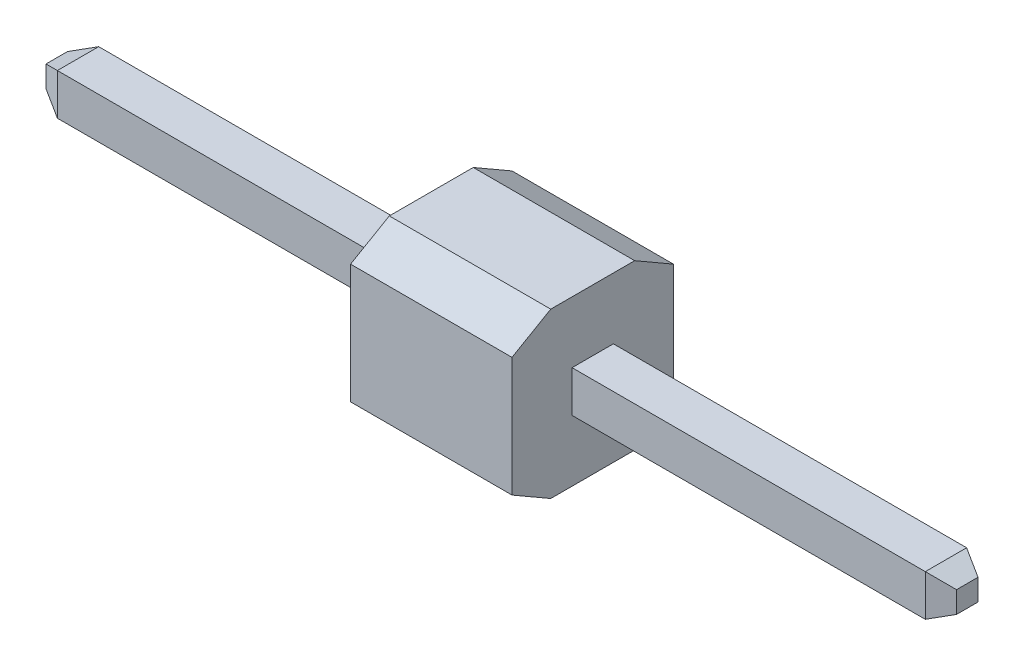
ISO-10303-21;
HEADER;
FILE_DESCRIPTION(('STEP AP214'),'2;1');
FILE_NAME('part.step','',(''),(''),'','','');
FILE_SCHEMA(('AUTOMOTIVE_DESIGN { 1 0 10303 214 1 1 1 1 }'));
ENDSEC;
DATA;
#1=APPLICATION_CONTEXT('core data for automotive mechanical design processes');
#2=APPLICATION_PROTOCOL_DEFINITION('international standard','automotive_design',2000,#1);
#3=PRODUCT_CONTEXT('',#1,'mechanical');
#4=PRODUCT('Part','Part','',(#3));
#5=PRODUCT_RELATED_PRODUCT_CATEGORY('part','',(#4));
#6=PRODUCT_DEFINITION_FORMATION('','',#4);
#7=PRODUCT_DEFINITION_CONTEXT('part definition',#1,'design');
#8=PRODUCT_DEFINITION('design','',#6,#7);
#9=PRODUCT_DEFINITION_SHAPE('','',#8);
#10=(LENGTH_UNIT() NAMED_UNIT(*) SI_UNIT(.MILLI.,.METRE.));
#11=(NAMED_UNIT(*) PLANE_ANGLE_UNIT() SI_UNIT($,.RADIAN.));
#12=(NAMED_UNIT(*) SI_UNIT($,.STERADIAN.) SOLID_ANGLE_UNIT());
#13=UNCERTAINTY_MEASURE_WITH_UNIT(LENGTH_MEASURE(1.E-05),#10,'distance_accuracy_value','');
#14=(GEOMETRIC_REPRESENTATION_CONTEXT(3) GLOBAL_UNCERTAINTY_ASSIGNED_CONTEXT((#13)) GLOBAL_UNIT_ASSIGNED_CONTEXT((#10,
#11,#12)) REPRESENTATION_CONTEXT('',''));
#15=CARTESIAN_POINT('',(0.,0.,0.));
#16=DIRECTION('',(0.,0.,1.));
#17=DIRECTION('',(1.,0.,0.));
#18=AXIS2_PLACEMENT_3D('',#15,#16,#17);
#19=CARTESIAN_POINT('',(5.42109994297276,-4.76288427394286,-2.77112015145706));
#20=DIRECTION('',(1.,-9.93476518829084E-08,4.37113882867379E-08));
#21=DIRECTION('',(-9.93476589883358E-08,-1.,8.74227765734759E-08));
#22=AXIS2_PLACEMENT_3D('',#19,#20,#21);
#23=PLANE('',#22);
#24=DIRECTION('',(-1.18186632778994E-08,-0.500000075710537,-0.866025360072935));
#25=VECTOR('',#24,1.);
#26=CARTESIAN_POINT('',(5.42109975079816,-6.00647397517509,-1.20112004273899));
#27=LINE('',#26,#25);
#28=CARTESIAN_POINT('',(5.42109975079816,-6.00647397517509,-1.20112004273899));
#29=VERTEX_POINT('',#28);
#30=CARTESIAN_POINT('',(5.42109974260995,-6.35288418914276,-1.80112001245485));
#31=VERTEX_POINT('',#30);
#32=EDGE_CURVE('E11',#29,#31,#27,.T.);
#33=ORIENTED_EDGE('',*,*,#32,.T.);
#34=DIRECTION('',(4.37113811813104E-08,-8.74227835422599E-08,-0.999999999999995));
#35=VECTOR('',#34,1.);
#36=CARTESIAN_POINT('',(5.42109974260995,-6.35288418914276,-1.80112001245485));
#37=LINE('',#36,#35);
#38=CARTESIAN_POINT('',(5.42109979943474,-6.35288430279238,-3.10112001245485));
#39=VERTEX_POINT('',#38);
#40=EDGE_CURVE('E304',#31,#39,#37,.T.);
#41=ORIENTED_EDGE('',*,*,#40,.T.);
#42=DIRECTION('',(8.75289963529268E-08,0.499999924289836,-0.866025447495713));
#43=VECTOR('',#42,1.);
#44=CARTESIAN_POINT('',(5.42109979943474,-6.35288430279238,-3.10112001245485));
#45=LINE('',#44,#43);
#46=CARTESIAN_POINT('',(5.42109986007661,-6.00647419373205,-3.70112004273898));
#47=VERTEX_POINT('',#46);
#48=EDGE_CURVE('E296',#39,#47,#45,.T.);
#49=ORIENTED_EDGE('',*,*,#48,.T.);
#50=DIRECTION('',(9.93476588435403E-08,0.999999999999991,-8.74227767225989E-08));
#51=VECTOR('',#50,1.);
#52=CARTESIAN_POINT('',(5.42109986007661,-6.00647419373205,-3.70112004273898));
#53=LINE('',#52,#51);
#54=CARTESIAN_POINT('',(5.42110004358959,-4.15929451676005,-3.70112020422456));
#55=VERTEX_POINT('',#54);
#56=EDGE_CURVE('E281',#47,#55,#53,.T.);
#57=ORIENTED_EDGE('',*,*,#56,.T.);
#58=DIRECTION('',(-1.18186632778994E-08,-0.500000075710538,-0.866025360072935));
#59=VECTOR('',#58,1.);
#60=CARTESIAN_POINT('',(5.4211000517778,-3.81288430279238,-3.1011202345087));
#61=LINE('',#60,#59);
#62=CARTESIAN_POINT('',(5.4211000517778,-3.81288430279238,-3.1011202345087));
#63=VERTEX_POINT('',#62);
#64=EDGE_CURVE('E265',#63,#55,#61,.T.);
#65=ORIENTED_EDGE('',*,*,#64,.F.);
#66=DIRECTION('',(4.37113811813104E-08,-8.74227828590458E-08,-0.999999999999995));
#67=VECTOR('',#66,1.);
#68=CARTESIAN_POINT('',(5.421099994953,-3.81288418914276,-1.8011202345087));
#69=LINE('',#68,#67);
#70=CARTESIAN_POINT('',(5.421099994953,-3.81288418914276,-1.8011202345087));
#71=VERTEX_POINT('',#70);
#72=EDGE_CURVE('E248',#71,#63,#69,.T.);
#73=ORIENTED_EDGE('',*,*,#72,.F.);
#74=DIRECTION('',(8.75289963529269E-08,0.499999924289835,-0.866025447495714));
#75=VECTOR('',#74,1.);
#76=CARTESIAN_POINT('',(5.42109993431113,-4.15929429820309,-1.20112020422456));
#77=LINE('',#76,#75);
#78=CARTESIAN_POINT('',(5.42109993431113,-4.15929429820309,-1.20112020422456));
#79=VERTEX_POINT('',#78);
#80=EDGE_CURVE('E242',#79,#71,#77,.T.);
#81=ORIENTED_EDGE('',*,*,#80,.F.);
#82=DIRECTION('',(9.93476588435403E-08,0.999999999999991,-8.74227763619768E-08));
#83=VECTOR('',#82,1.);
#84=CARTESIAN_POINT('',(5.42109975079816,-6.00647397517509,-1.20112004273899));
#85=LINE('',#84,#83);
#86=EDGE_CURVE('E236',#29,#79,#85,.T.);
#87=ORIENTED_EDGE('',*,*,#86,.F.);
#88=EDGE_LOOP('',(#33,#41,#49,#57,#65,#73,#81,#87));
#89=FACE_BOUND('',#88,.T.);
#90=DIRECTION('',(-4.37113817364219E-08,8.74227842895255E-08,0.999999999999995));
#91=VECTOR('',#90,1.);
#92=CARTESIAN_POINT('',(5.42109987939026,-5.40288427394286,-2.77112009550648));
#93=LINE('',#92,#91);
#94=CARTESIAN_POINT('',(5.42109987939026,-5.40288427394286,-2.77112009550648));
#95=VERTEX_POINT('',#94);
#96=CARTESIAN_POINT('',(5.42109985141498,-5.40288421799228,-2.13112009550648));
#97=VERTEX_POINT('',#96);
#98=EDGE_CURVE('E302',#95,#97,#93,.T.);
#99=ORIENTED_EDGE('',*,*,#98,.T.);
#100=DIRECTION('',(-9.93476592658907E-08,-0.999999999999991,8.74227759628525E-08));
#101=VECTOR('',#100,1.);
#102=CARTESIAN_POINT('',(5.42109991499748,-4.76288421799228,-2.13112015145706));
#103=LINE('',#102,#101);
#104=CARTESIAN_POINT('',(5.42109991499748,-4.76288421799228,-2.13112015145706));
#105=VERTEX_POINT('',#104);
#106=EDGE_CURVE('E293',#105,#97,#103,.T.);
#107=ORIENTED_EDGE('',*,*,#106,.F.);
#108=DIRECTION('',(-4.37113803486431E-08,8.74227842895254E-08,0.999999999999995));
#109=VECTOR('',#108,1.);
#110=CARTESIAN_POINT('',(5.42109994297276,-4.76288427394286,-2.77112015145706));
#111=LINE('',#110,#109);
#112=CARTESIAN_POINT('',(5.42109994297276,-4.76288427394286,-2.77112015145706));
#113=VERTEX_POINT('',#112);
#114=EDGE_CURVE('E278',#113,#105,#111,.T.);
#115=ORIENTED_EDGE('',*,*,#114,.F.);
#116=DIRECTION('',(-9.93476578781119E-08,-0.999999999999991,8.74227766567419E-08));
#117=VECTOR('',#116,1.);
#118=CARTESIAN_POINT('',(5.42109994297276,-4.76288427394286,-2.77112015145706));
#119=LINE('',#118,#117);
#120=EDGE_CURVE('E263',#113,#95,#119,.T.);
#121=ORIENTED_EDGE('',*,*,#120,.T.);
#122=EDGE_LOOP('',(#99,#107,#115,#121));
#123=FACE_BOUND('',#122,.T.);
#124=ADVANCED_FACE('F17',(#89,#123),#23,.T.);
#125=CARTESIAN_POINT('',(2.92109994297277,-4.76288402557373,-2.77112026073553));
#126=DIRECTION('',(1.,-9.93476518829084E-08,4.37113882867379E-08));
#127=DIRECTION('',(-9.93476589883358E-08,-1.,8.74227765734759E-08));
#128=AXIS2_PLACEMENT_3D('',#125,#126,#127);
#129=PLANE('',#128);
#130=DIRECTION('',(-1.18186626369119E-08,-0.500000075710537,-0.866025360072935));
#131=VECTOR('',#130,1.);
#132=CARTESIAN_POINT('',(2.92109975079816,-6.00647372680596,-1.20112015201746));
#133=LINE('',#132,#131);
#134=CARTESIAN_POINT('',(2.92109975079816,-6.00647372680596,-1.20112015201746));
#135=VERTEX_POINT('',#134);
#136=CARTESIAN_POINT('',(2.92109974260995,-6.35288394077363,-1.80112012173332));
#137=VERTEX_POINT('',#136);
#138=EDGE_CURVE('E24',#135,#137,#133,.T.);
#139=ORIENTED_EDGE('',*,*,#138,.F.);
#140=DIRECTION('',(9.9347659083955E-08,0.999999999999991,-8.74227763619768E-08));
#141=VECTOR('',#140,1.);
#142=CARTESIAN_POINT('',(2.92109975079816,-6.00647372680596,-1.20112015201746));
#143=LINE('',#142,#141);
#144=CARTESIAN_POINT('',(2.92109993431113,-4.15929404983396,-1.20112031350303));
#145=VERTEX_POINT('',#144);
#146=EDGE_CURVE('E300',#135,#145,#143,.T.);
#147=ORIENTED_EDGE('',*,*,#146,.T.);
#148=DIRECTION('',(8.75289957119393E-08,0.499999924289835,-0.866025447495714));
#149=VECTOR('',#148,1.);
#150=CARTESIAN_POINT('',(2.92109993431113,-4.15929404983396,-1.20112031350303));
#151=LINE('',#150,#149);
#152=CARTESIAN_POINT('',(2.921099994953,-3.81288394077363,-1.80112034378717));
#153=VERTEX_POINT('',#152);
#154=EDGE_CURVE('E286',#145,#153,#151,.T.);
#155=ORIENTED_EDGE('',*,*,#154,.T.);
#156=DIRECTION('',(4.37113811813104E-08,-8.74227828590458E-08,-0.999999999999995));
#157=VECTOR('',#156,1.);
#158=CARTESIAN_POINT('',(2.921099994953,-3.81288394077363,-1.80112034378717));
#159=LINE('',#158,#157);
#160=CARTESIAN_POINT('',(2.9211000517778,-3.81288405442325,-3.10112034378717));
#161=VERTEX_POINT('',#160);
#162=EDGE_CURVE('E271',#153,#161,#159,.T.);
#163=ORIENTED_EDGE('',*,*,#162,.T.);
#164=DIRECTION('',(-1.18186626369119E-08,-0.500000075710538,-0.866025360072935));
#165=VECTOR('',#164,1.);
#166=CARTESIAN_POINT('',(2.9211000517778,-3.81288405442325,-3.10112034378717));
#167=LINE('',#166,#165);
#168=CARTESIAN_POINT('',(2.92110004358959,-4.15929426839092,-3.70112031350303));
#169=VERTEX_POINT('',#168);
#170=EDGE_CURVE('E253',#161,#169,#167,.T.);
#171=ORIENTED_EDGE('',*,*,#170,.T.);
#172=DIRECTION('',(9.9347659083955E-08,0.999999999999991,-8.74227767225989E-08));
#173=VECTOR('',#172,1.);
#174=CARTESIAN_POINT('',(2.92109986007661,-6.00647394536292,-3.70112015201746));
#175=LINE('',#174,#173);
#176=CARTESIAN_POINT('',(2.92109986007661,-6.00647394536292,-3.70112015201746));
#177=VERTEX_POINT('',#176);
#178=EDGE_CURVE('E261',#177,#169,#175,.T.);
#179=ORIENTED_EDGE('',*,*,#178,.F.);
#180=DIRECTION('',(8.75289957119392E-08,0.499999924289836,-0.866025447495713));
#181=VECTOR('',#180,1.);
#182=CARTESIAN_POINT('',(2.92109979943474,-6.35288405442325,-3.10112012173332));
#183=LINE('',#182,#181);
#184=CARTESIAN_POINT('',(2.92109979943474,-6.35288405442325,-3.10112012173332));
#185=VERTEX_POINT('',#184);
#186=EDGE_CURVE('E276',#185,#177,#183,.T.);
#187=ORIENTED_EDGE('',*,*,#186,.F.);
#188=DIRECTION('',(4.37113811813104E-08,-8.74227835422599E-08,-0.999999999999995));
#189=VECTOR('',#188,1.);
#190=CARTESIAN_POINT('',(2.92109974260995,-6.35288394077363,-1.80112012173332));
#191=LINE('',#190,#189);
#192=EDGE_CURVE('E291',#137,#185,#191,.T.);
#193=ORIENTED_EDGE('',*,*,#192,.F.);
#194=EDGE_LOOP('',(#139,#147,#155,#163,#171,#179,#187,#193));
#195=FACE_BOUND('',#194,.T.);
#196=DIRECTION('',(-9.93476592658907E-08,-0.999999999999991,8.74227759628525E-08));
#197=VECTOR('',#196,1.);
#198=CARTESIAN_POINT('',(2.92109991499748,-4.76288396962315,-2.13112026073553));
#199=LINE('',#198,#197);
#200=CARTESIAN_POINT('',(2.92109991499748,-4.76288396962315,-2.13112026073553));
#201=VERTEX_POINT('',#200);
#202=CARTESIAN_POINT('',(2.92109985141498,-5.40288396962315,-2.13112020478496));
#203=VERTEX_POINT('',#202);
#204=EDGE_CURVE('E298',#201,#203,#199,.T.);
#205=ORIENTED_EDGE('',*,*,#204,.T.);
#206=DIRECTION('',(-4.37113810425325E-08,8.74227842895255E-08,0.999999999999995));
#207=VECTOR('',#206,1.);
#208=CARTESIAN_POINT('',(2.92109987939026,-5.40288402557373,-2.77112020478496));
#209=LINE('',#208,#207);
#210=CARTESIAN_POINT('',(2.92109987939026,-5.40288402557373,-2.77112020478496));
#211=VERTEX_POINT('',#210);
#212=EDGE_CURVE('E283',#211,#203,#209,.T.);
#213=ORIENTED_EDGE('',*,*,#212,.F.);
#214=DIRECTION('',(-9.93476592658907E-08,-0.999999999999991,8.74227766567419E-08));
#215=VECTOR('',#214,1.);
#216=CARTESIAN_POINT('',(2.92109994297277,-4.76288402557373,-2.77112026073553));
#217=LINE('',#216,#215);
#218=CARTESIAN_POINT('',(2.92109994297277,-4.76288402557373,-2.77112026073553));
#219=VERTEX_POINT('',#218);
#220=EDGE_CURVE('E268',#219,#211,#217,.T.);
#221=ORIENTED_EDGE('',*,*,#220,.F.);
#222=DIRECTION('',(-4.37113810425325E-08,8.74227842895254E-08,0.999999999999995));
#223=VECTOR('',#222,1.);
#224=CARTESIAN_POINT('',(2.92109994297277,-4.76288402557373,-2.77112026073553));
#225=LINE('',#224,#223);
#226=EDGE_CURVE('E251',#219,#201,#225,.T.);
#227=ORIENTED_EDGE('',*,*,#226,.T.);
#228=EDGE_LOOP('',(#205,#213,#221,#227));
#229=FACE_BOUND('',#228,.T.);
#230=ADVANCED_FACE('F314',(#195,#229),#129,.F.);
#231=CARTESIAN_POINT('',(5.42109975079816,-6.00647397517509,-1.20112004273899));
#232=DIRECTION('',(1.07893287081065E-07,0.866025360072937,-0.500000075710535));
#233=DIRECTION('',(1.18186629566715E-08,0.500000075710542,0.866025360072941));
#234=AXIS2_PLACEMENT_3D('',#231,#232,#233);
#235=PLANE('',#234);
#236=ORIENTED_EDGE('',*,*,#138,.T.);
#237=DIRECTION('',(-0.999999999999994,9.93476522381792E-08,-4.37113884643734E-08));
#238=VECTOR('',#237,1.);
#239=CARTESIAN_POINT('',(5.42109974260995,-6.35288418914276,-1.80112001245485));
#240=LINE('',#239,#238);
#241=EDGE_CURVE('E288',#31,#137,#240,.T.);
#242=ORIENTED_EDGE('',*,*,#241,.F.);
#243=ORIENTED_EDGE('',*,*,#32,.F.);
#244=DIRECTION('',(-0.999999999999994,9.93476525934505E-08,-4.3711388109102E-08));
#245=VECTOR('',#244,1.);
#246=CARTESIAN_POINT('',(5.42109975079816,-6.00647397517509,-1.20112004273899));
#247=LINE('',#246,#245);
#248=EDGE_CURVE('E256',#29,#135,#247,.T.);
#249=ORIENTED_EDGE('',*,*,#248,.T.);
#250=EDGE_LOOP('',(#236,#242,#243,#249));
#251=FACE_BOUND('',#250,.T.);
#252=ADVANCED_FACE('F306',(#251),#235,.F.);
#253=CARTESIAN_POINT('',(5.42109974260995,-6.35288418914276,-1.80112001245485));
#254=DIRECTION('',(9.93476589883358E-08,1.,-8.74227765734759E-08));
#255=DIRECTION('',(1.,-9.93476518829084E-08,4.37113882867379E-08));
#256=AXIS2_PLACEMENT_3D('',#253,#254,#255);
#257=PLANE('',#256);
#258=ORIENTED_EDGE('',*,*,#192,.T.);
#259=DIRECTION('',(-0.999999999999994,9.93476522381792E-08,-4.37113882867377E-08));
#260=VECTOR('',#259,1.);
#261=CARTESIAN_POINT('',(5.42109979943474,-6.35288430279238,-3.10112001245485));
#262=LINE('',#261,#260);
#263=EDGE_CURVE('E273',#39,#185,#262,.T.);
#264=ORIENTED_EDGE('',*,*,#263,.F.);
#265=ORIENTED_EDGE('',*,*,#40,.F.);
#266=ORIENTED_EDGE('',*,*,#241,.T.);
#267=EDGE_LOOP('',(#258,#264,#265,#266));
#268=FACE_BOUND('',#267,.T.);
#269=ADVANCED_FACE('F311',(#268),#257,.F.);
#270=CARTESIAN_POINT('',(5.42109979943474,-6.35288430279238,-3.10112001245485));
#271=DIRECTION('',(6.41819058997377E-08,0.866025447495721,0.499999924289845));
#272=DIRECTION('',(-8.7528996031702E-08,-0.499999924289838,0.866025447495717));
#273=AXIS2_PLACEMENT_3D('',#270,#271,#272);
#274=PLANE('',#273);
#275=ORIENTED_EDGE('',*,*,#186,.T.);
#276=DIRECTION('',(-0.999999999999994,9.93476525934505E-08,-4.37113884643734E-08));
#277=VECTOR('',#276,1.);
#278=CARTESIAN_POINT('',(5.42109986007661,-6.00647419373205,-3.70112004273898));
#279=LINE('',#278,#277);
#280=EDGE_CURVE('E258',#47,#177,#279,.T.);
#281=ORIENTED_EDGE('',*,*,#280,.F.);
#282=ORIENTED_EDGE('',*,*,#48,.F.);
#283=ORIENTED_EDGE('',*,*,#263,.T.);
#284=EDGE_LOOP('',(#275,#281,#282,#283));
#285=FACE_BOUND('',#284,.T.);
#286=ADVANCED_FACE('F319',(#285),#274,.F.);
#287=CARTESIAN_POINT('',(5.42109986007661,-6.00647419373205,-3.70112004273898));
#288=DIRECTION('',(-4.37113811813106E-08,8.74227836789032E-08,1.));
#289=DIRECTION('',(-1.,9.93476518829084E-08,-4.37113882867379E-08));
#290=AXIS2_PLACEMENT_3D('',#287,#288,#289);
#291=PLANE('',#290);
#292=ORIENTED_EDGE('',*,*,#178,.T.);
#293=DIRECTION('',(-0.999999999999994,9.93476518829078E-08,-4.37113882867377E-08));
#294=VECTOR('',#293,1.);
#295=CARTESIAN_POINT('',(5.42110004358959,-4.15929451676005,-3.70112020422456));
#296=LINE('',#295,#294);
#297=EDGE_CURVE('E245',#55,#169,#296,.T.);
#298=ORIENTED_EDGE('',*,*,#297,.F.);
#299=ORIENTED_EDGE('',*,*,#56,.F.);
#300=ORIENTED_EDGE('',*,*,#280,.T.);
#301=EDGE_LOOP('',(#292,#298,#299,#300));
#302=FACE_BOUND('',#301,.T.);
#303=ADVANCED_FACE('F326',(#302),#291,.F.);
#304=CARTESIAN_POINT('',(5.4211000517778,-3.81288430279238,-3.1011202345087));
#305=DIRECTION('',(1.07893287081065E-07,0.866025360072937,-0.500000075710535));
#306=DIRECTION('',(1.18186629566715E-08,0.500000075710542,0.866025360072941));
#307=AXIS2_PLACEMENT_3D('',#304,#305,#306);
#308=PLANE('',#307);
#309=ORIENTED_EDGE('',*,*,#170,.F.);
#310=DIRECTION('',(-0.999999999999994,9.93476518829078E-08,-4.37113884643734E-08));
#311=VECTOR('',#310,1.);
#312=CARTESIAN_POINT('',(5.4211000517778,-3.81288430279238,-3.1011202345087));
#313=LINE('',#312,#311);
#314=EDGE_CURVE('E239',#63,#161,#313,.T.);
#315=ORIENTED_EDGE('',*,*,#314,.F.);
#316=ORIENTED_EDGE('',*,*,#64,.T.);
#317=ORIENTED_EDGE('',*,*,#297,.T.);
#318=EDGE_LOOP('',(#309,#315,#316,#317));
#319=FACE_BOUND('',#318,.T.);
#320=ADVANCED_FACE('F329',(#319),#308,.T.);
#321=CARTESIAN_POINT('',(5.421099994953,-3.81288418914276,-1.8011202345087));
#322=DIRECTION('',(9.93476589883358E-08,1.,-8.74227765734759E-08));
#323=DIRECTION('',(1.,-9.93476518829084E-08,4.37113882867379E-08));
#324=AXIS2_PLACEMENT_3D('',#321,#322,#323);
#325=PLANE('',#324);
#326=ORIENTED_EDGE('',*,*,#162,.F.);
#327=DIRECTION('',(-0.999999999999994,9.93476518829078E-08,-4.37113883755555E-08));
#328=VECTOR('',#327,1.);
#329=CARTESIAN_POINT('',(5.421099994953,-3.81288418914276,-1.8011202345087));
#330=LINE('',#329,#328);
#331=EDGE_CURVE('E233',#71,#153,#330,.T.);
#332=ORIENTED_EDGE('',*,*,#331,.F.);
#333=ORIENTED_EDGE('',*,*,#72,.T.);
#334=ORIENTED_EDGE('',*,*,#314,.T.);
#335=EDGE_LOOP('',(#326,#332,#333,#334));
#336=FACE_BOUND('',#335,.T.);
#337=ADVANCED_FACE('F333',(#336),#325,.T.);
#338=CARTESIAN_POINT('',(5.42109993431113,-4.15929429820309,-1.20112020422456));
#339=DIRECTION('',(6.41819058997377E-08,0.866025447495721,0.499999924289845));
#340=DIRECTION('',(-8.7528996031702E-08,-0.499999924289838,0.866025447495717));
#341=AXIS2_PLACEMENT_3D('',#338,#339,#340);
#342=PLANE('',#341);
#343=ORIENTED_EDGE('',*,*,#154,.F.);
#344=DIRECTION('',(-0.999999999999994,9.93476518829078E-08,-4.3711388109102E-08));
#345=VECTOR('',#344,1.);
#346=CARTESIAN_POINT('',(5.42109993431113,-4.15929429820309,-1.20112020422456));
#347=LINE('',#346,#345);
#348=EDGE_CURVE('E230',#79,#145,#347,.T.);
#349=ORIENTED_EDGE('',*,*,#348,.F.);
#350=ORIENTED_EDGE('',*,*,#80,.T.);
#351=ORIENTED_EDGE('',*,*,#331,.T.);
#352=EDGE_LOOP('',(#343,#349,#350,#351));
#353=FACE_BOUND('',#352,.T.);
#354=ADVANCED_FACE('F337',(#353),#342,.T.);
#355=CARTESIAN_POINT('',(5.42109975079816,-6.00647397517509,-1.20112004273899));
#356=DIRECTION('',(-4.37113811813106E-08,8.74227835615132E-08,1.));
#357=DIRECTION('',(-9.93476589883358E-08,-1.,8.74227764560859E-08));
#358=AXIS2_PLACEMENT_3D('',#355,#356,#357);
#359=PLANE('',#358);
#360=ORIENTED_EDGE('',*,*,#146,.F.);
#361=ORIENTED_EDGE('',*,*,#248,.F.);
#362=ORIENTED_EDGE('',*,*,#86,.T.);
#363=ORIENTED_EDGE('',*,*,#348,.T.);
#364=EDGE_LOOP('',(#360,#361,#362,#363));
#365=FACE_BOUND('',#364,.T.);
#366=ADVANCED_FACE('F339',(#365),#359,.T.);
#367=CARTESIAN_POINT('',(-2.87890005702724,-4.76288344935735,-2.77112051426158));
#368=DIRECTION('',(-1.,9.93476518829084E-08,-4.37113882867379E-08));
#369=DIRECTION('',(9.93476589883358E-08,1.,-8.74227765734759E-08));
#370=AXIS2_PLACEMENT_3D('',#367,#368,#369);
#371=PLANE('',#370);
#372=DIRECTION('',(9.93476661653848E-08,0.999999999999991,-8.74227774760713E-08));
#373=VECTOR('',#372,1.);
#374=CARTESIAN_POINT('',(-2.87890012657088,-5.24900187966852,-2.28500199895476));
#375=LINE('',#374,#373);
#376=CARTESIAN_POINT('',(-2.87890012657088,-5.24900187966852,-2.28500199895476));
#377=VERTEX_POINT('',#376);
#378=CARTESIAN_POINT('',(-2.87890009356391,-4.91676493405052,-2.28500202799983));
#379=VERTEX_POINT('',#378);
#380=EDGE_CURVE('E228',#377,#379,#375,.T.);
#381=ORIENTED_EDGE('',*,*,#380,.T.);
#382=DIRECTION('',(4.37113793813867E-08,-8.74227828227278E-08,-0.999999999999995));
#383=VECTOR('',#382,1.);
#384=CARTESIAN_POINT('',(-2.87890009356391,-4.91676493405052,-2.28500202799983));
#385=LINE('',#384,#383);
#386=CARTESIAN_POINT('',(-2.87890007904138,-4.9167649630956,-2.61723897361783));
#387=VERTEX_POINT('',#386);
#388=EDGE_CURVE('E223',#379,#387,#385,.T.);
#389=ORIENTED_EDGE('',*,*,#388,.T.);
#390=DIRECTION('',(-9.9347660818728E-08,-0.999999999999991,8.74227774760711E-08));
#391=VECTOR('',#390,1.);
#392=CARTESIAN_POINT('',(-2.87890007904138,-4.9167649630956,-2.61723897361783));
#393=LINE('',#392,#391);
#394=CARTESIAN_POINT('',(-2.87890011204834,-5.2490019087136,-2.61723894457276));
#395=VERTEX_POINT('',#394);
#396=EDGE_CURVE('E215',#387,#395,#393,.T.);
#397=ORIENTED_EDGE('',*,*,#396,.T.);
#398=DIRECTION('',(-4.37113767080584E-08,8.74227801493995E-08,0.999999999999995));
#399=VECTOR('',#398,1.);
#400=CARTESIAN_POINT('',(-2.87890011204834,-5.2490019087136,-2.61723894457276));
#401=LINE('',#400,#399);
#402=EDGE_CURVE('E207',#395,#377,#401,.T.);
#403=ORIENTED_EDGE('',*,*,#402,.T.);
#404=EDGE_LOOP('',(#381,#389,#397,#403));
#405=FACE_BOUND('',#404,.T.);
#406=ADVANCED_FACE('F341',(#405),#371,.T.);
#407=CARTESIAN_POINT('',(-2.87890005702724,-4.76288344935735,-2.77112051426158));
#408=DIRECTION('',(9.93476589883358E-08,1.,-8.74227764510112E-08));
#409=DIRECTION('',(-4.37113811813106E-08,8.74227835564385E-08,1.));
#410=AXIS2_PLACEMENT_3D('',#407,#408,#409);
#411=PLANE('',#410);
#412=DIRECTION('',(0.999999999999994,-9.93476524284799E-08,4.37113882769953E-08));
#413=VECTOR('',#412,1.);
#414=CARTESIAN_POINT('',(-2.54890005702724,-4.76288348214207,-2.77112049983683));
#415=LINE('',#414,#413);
#416=CARTESIAN_POINT('',(-2.54890005702724,-4.76288348214207,-2.77112049983683));
#417=VERTEX_POINT('',#416);
#418=EDGE_CURVE('E225',#417,#219,#415,.T.);
#419=ORIENTED_EDGE('',*,*,#418,.F.);
#420=DIRECTION('',(-4.37113803486431E-08,8.74227842895254E-08,0.999999999999995));
#421=VECTOR('',#420,1.);
#422=CARTESIAN_POINT('',(-2.54890005702724,-4.76288348214207,-2.77112049983683));
#423=LINE('',#422,#421);
#424=CARTESIAN_POINT('',(-2.54890008500252,-4.76288342619149,-2.13112049983683));
#425=VERTEX_POINT('',#424);
#426=EDGE_CURVE('E217',#417,#425,#423,.T.);
#427=ORIENTED_EDGE('',*,*,#426,.T.);
#428=DIRECTION('',(0.999999999999994,-9.93476524284799E-08,4.3711388195809E-08));
#429=VECTOR('',#428,1.);
#430=CARTESIAN_POINT('',(-2.54890008500252,-4.76288342619149,-2.13112049983683));
#431=LINE('',#430,#429);
#432=EDGE_CURVE('E220',#425,#201,#431,.T.);
#433=ORIENTED_EDGE('',*,*,#432,.T.);
#434=ORIENTED_EDGE('',*,*,#226,.F.);
#435=EDGE_LOOP('',(#419,#427,#433,#434));
#436=FACE_BOUND('',#435,.T.);
#437=ADVANCED_FACE('F348',(#436),#411,.T.);
#438=CARTESIAN_POINT('',(-2.87890008500252,-4.76288339340677,-2.13112051426158));
#439=DIRECTION('',(-4.37113811813106E-08,8.74227836789032E-08,1.));
#440=DIRECTION('',(-1.,9.93476518829084E-08,-4.37113882867379E-08));
#441=AXIS2_PLACEMENT_3D('',#438,#439,#440);
#442=PLANE('',#441);
#443=ORIENTED_EDGE('',*,*,#432,.F.);
#444=DIRECTION('',(-9.93476592658907E-08,-0.999999999999991,8.74227766567419E-08));
#445=VECTOR('',#444,1.);
#446=CARTESIAN_POINT('',(-2.54890008500252,-4.76288342619149,-2.13112049983683));
#447=LINE('',#446,#445);
#448=CARTESIAN_POINT('',(-2.54890014858502,-5.40288342619149,-2.13112044388625));
#449=VERTEX_POINT('',#448);
#450=EDGE_CURVE('E209',#425,#449,#447,.T.);
#451=ORIENTED_EDGE('',*,*,#450,.T.);
#452=DIRECTION('',(0.999999999999994,-9.93476512918714E-08,4.3711388195809E-08));
#453=VECTOR('',#452,1.);
#454=CARTESIAN_POINT('',(-2.54890014858502,-5.40288342619149,-2.13112044388625));
#455=LINE('',#454,#453);
#456=EDGE_CURVE('E212',#449,#203,#455,.T.);
#457=ORIENTED_EDGE('',*,*,#456,.T.);
#458=ORIENTED_EDGE('',*,*,#204,.F.);
#459=EDGE_LOOP('',(#443,#451,#457,#458));
#460=FACE_BOUND('',#459,.T.);
#461=ADVANCED_FACE('F424',(#460),#442,.T.);
#462=CARTESIAN_POINT('',(-2.87890012060974,-5.40288344935735,-2.77112045831101));
#463=DIRECTION('',(9.93476589883357E-08,1.,-8.74227764040693E-08));
#464=DIRECTION('',(-4.37113811813106E-08,8.74227835094966E-08,1.));
#465=AXIS2_PLACEMENT_3D('',#462,#463,#464);
#466=PLANE('',#465);
#467=ORIENTED_EDGE('',*,*,#456,.F.);
#468=DIRECTION('',(4.37113831242006E-08,-8.7422787065083E-08,-0.999999999999995));
#469=VECTOR('',#468,1.);
#470=CARTESIAN_POINT('',(-2.54890014858502,-5.40288342619149,-2.13112044388625));
#471=LINE('',#470,#469);
#472=CARTESIAN_POINT('',(-2.54890012060974,-5.40288348214207,-2.77112044388625));
#473=VERTEX_POINT('',#472);
#474=EDGE_CURVE('E201',#449,#473,#471,.T.);
#475=ORIENTED_EDGE('',*,*,#474,.T.);
#476=DIRECTION('',(0.999999999999994,-9.93476512918714E-08,4.37113882769953E-08));
#477=VECTOR('',#476,1.);
#478=CARTESIAN_POINT('',(-2.54890012060974,-5.40288348214207,-2.77112044388625));
#479=LINE('',#478,#477);
#480=EDGE_CURVE('E204',#473,#211,#479,.T.);
#481=ORIENTED_EDGE('',*,*,#480,.T.);
#482=ORIENTED_EDGE('',*,*,#212,.T.);
#483=EDGE_LOOP('',(#467,#475,#481,#482));
#484=FACE_BOUND('',#483,.T.);
#485=ADVANCED_FACE('F421',(#484),#466,.F.);
#486=CARTESIAN_POINT('',(-2.87890005702724,-4.76288344935735,-2.77112051426158));
#487=DIRECTION('',(-4.37113811813106E-08,8.74227836789032E-08,1.));
#488=DIRECTION('',(-1.,9.93476518829084E-08,-4.37113882867379E-08));
#489=AXIS2_PLACEMENT_3D('',#486,#487,#488);
#490=PLANE('',#489);
#491=ORIENTED_EDGE('',*,*,#480,.F.);
#492=DIRECTION('',(9.9347659265891E-08,0.999999999999991,-8.74227766567421E-08));
#493=VECTOR('',#492,1.);
#494=CARTESIAN_POINT('',(-2.54890012060974,-5.40288348214207,-2.77112044388625));
#495=LINE('',#494,#493);
#496=EDGE_CURVE('E196',#473,#417,#495,.T.);
#497=ORIENTED_EDGE('',*,*,#496,.T.);
#498=ORIENTED_EDGE('',*,*,#418,.T.);
#499=ORIENTED_EDGE('',*,*,#220,.T.);
#500=EDGE_LOOP('',(#491,#497,#498,#499));
#501=FACE_BOUND('',#500,.T.);
#502=ADVANCED_FACE('F376',(#501),#490,.F.);
#503=CARTESIAN_POINT('',(-2.87890005702724,-4.76288344935735,-2.77112051426158));
#504=DIRECTION('',(-4.37113811813106E-08,8.74227836789032E-08,1.));
#505=DIRECTION('',(-1.,9.93476518829084E-08,-4.37113882867379E-08));
#506=AXIS2_PLACEMENT_3D('',#503,#504,#505);
#507=PLANE('',#506);
#508=DIRECTION('',(0.999999999999994,-9.93476545393245E-08,4.37113882769953E-08));
#509=VECTOR('',#508,1.);
#510=CARTESIAN_POINT('',(5.42109994297276,-4.76288427394286,-2.77112015145706));
#511=LINE('',#510,#509);
#512=CARTESIAN_POINT('',(10.8910999429728,-4.76288481737452,-2.77111991235577));
#513=VERTEX_POINT('',#512);
#514=EDGE_CURVE('E199',#113,#513,#511,.T.);
#515=ORIENTED_EDGE('',*,*,#514,.T.);
#516=DIRECTION('',(-9.93476606536695E-08,-0.999999999999991,8.74227766567419E-08));
#517=VECTOR('',#516,1.);
#518=CARTESIAN_POINT('',(10.8910999429728,-4.76288481737452,-2.77111991235577));
#519=LINE('',#518,#517);
#520=CARTESIAN_POINT('',(10.8910998793903,-5.40288481737452,-2.77111985640519));
#521=VERTEX_POINT('',#520);
#522=EDGE_CURVE('E191',#513,#521,#519,.T.);
#523=ORIENTED_EDGE('',*,*,#522,.T.);
#524=DIRECTION('',(0.999999999999994,-9.93476545393245E-08,4.37113882769953E-08));
#525=VECTOR('',#524,1.);
#526=CARTESIAN_POINT('',(5.42109987939026,-5.40288427394286,-2.77112009550648));
#527=LINE('',#526,#525);
#528=EDGE_CURVE('E194',#95,#521,#527,.T.);
#529=ORIENTED_EDGE('',*,*,#528,.F.);
#530=ORIENTED_EDGE('',*,*,#120,.F.);
#531=EDGE_LOOP('',(#515,#523,#529,#530));
#532=FACE_BOUND('',#531,.T.);
#533=ADVANCED_FACE('F367',(#532),#507,.F.);
#534=CARTESIAN_POINT('',(-2.87890012060974,-5.40288344935735,-2.77112045831101));
#535=DIRECTION('',(9.93476589883357E-08,1.,-8.74227764040693E-08));
#536=DIRECTION('',(-4.37113811813106E-08,8.74227835094966E-08,1.));
#537=AXIS2_PLACEMENT_3D('',#534,#535,#536);
#538=PLANE('',#537);
#539=ORIENTED_EDGE('',*,*,#528,.T.);
#540=DIRECTION('',(-4.37113845119794E-08,8.74227842895254E-08,0.999999999999995));
#541=VECTOR('',#540,1.);
#542=CARTESIAN_POINT('',(10.8910998793903,-5.40288481737452,-2.77111985640519));
#543=LINE('',#542,#541);
#544=CARTESIAN_POINT('',(10.891099851415,-5.40288476142393,-2.13111985640519));
#545=VERTEX_POINT('',#544);
#546=EDGE_CURVE('E186',#521,#545,#543,.T.);
#547=ORIENTED_EDGE('',*,*,#546,.T.);
#548=DIRECTION('',(0.999999999999994,-9.93476545393245E-08,4.37113881146227E-08));
#549=VECTOR('',#548,1.);
#550=CARTESIAN_POINT('',(5.42109985141498,-5.40288421799227,-2.13112009550648));
#551=LINE('',#550,#549);
#552=EDGE_CURVE('E189',#97,#545,#551,.T.);
#553=ORIENTED_EDGE('',*,*,#552,.F.);
#554=ORIENTED_EDGE('',*,*,#98,.F.);
#555=EDGE_LOOP('',(#539,#547,#553,#554));
#556=FACE_BOUND('',#555,.T.);
#557=ADVANCED_FACE('F364',(#556),#538,.F.);
#558=CARTESIAN_POINT('',(-2.87890008500252,-4.76288339340677,-2.13112051426158));
#559=DIRECTION('',(-4.37113811813106E-08,8.74227836789032E-08,1.));
#560=DIRECTION('',(-1.,9.93476518829084E-08,-4.37113882867379E-08));
#561=AXIS2_PLACEMENT_3D('',#558,#559,#560);
#562=PLANE('',#561);
#563=ORIENTED_EDGE('',*,*,#552,.T.);
#564=DIRECTION('',(9.93476578781122E-08,0.999999999999991,-8.74227759628527E-08));
#565=VECTOR('',#564,1.);
#566=CARTESIAN_POINT('',(10.891099851415,-5.40288476142393,-2.13111985640519));
#567=LINE('',#566,#565);
#568=CARTESIAN_POINT('',(10.8910999149975,-4.76288476142393,-2.13111991235577));
#569=VERTEX_POINT('',#568);
#570=EDGE_CURVE('E176',#545,#569,#567,.T.);
#571=ORIENTED_EDGE('',*,*,#570,.T.);
#572=DIRECTION('',(0.999999999999994,-9.93476545393245E-08,4.37113881146227E-08));
#573=VECTOR('',#572,1.);
#574=CARTESIAN_POINT('',(5.42109991499748,-4.76288421799227,-2.13112015145706));
#575=LINE('',#574,#573);
#576=EDGE_CURVE('E179',#105,#569,#575,.T.);
#577=ORIENTED_EDGE('',*,*,#576,.F.);
#578=ORIENTED_EDGE('',*,*,#106,.T.);
#579=EDGE_LOOP('',(#563,#571,#577,#578));
#580=FACE_BOUND('',#579,.T.);
#581=ADVANCED_FACE('F366',(#580),#562,.T.);
#582=CARTESIAN_POINT('',(-2.87890005702724,-4.76288344935735,-2.77112051426158));
#583=DIRECTION('',(9.93476589883358E-08,1.,-8.74227764510112E-08));
#584=DIRECTION('',(-4.37113811813106E-08,8.74227835564385E-08,1.));
#585=AXIS2_PLACEMENT_3D('',#582,#583,#584);
#586=PLANE('',#585);
#587=ORIENTED_EDGE('',*,*,#576,.T.);
#588=DIRECTION('',(4.37113789608643E-08,-8.74227842895254E-08,-0.999999999999995));
#589=VECTOR('',#588,1.);
#590=CARTESIAN_POINT('',(10.8910999149975,-4.76288476142393,-2.13111991235577));
#591=LINE('',#590,#589);
#592=EDGE_CURVE('E167',#569,#513,#591,.T.);
#593=ORIENTED_EDGE('',*,*,#592,.T.);
#594=ORIENTED_EDGE('',*,*,#514,.F.);
#595=ORIENTED_EDGE('',*,*,#114,.T.);
#596=EDGE_LOOP('',(#587,#593,#594,#595));
#597=FACE_BOUND('',#596,.T.);
#598=ADVANCED_FACE('F373',(#597),#586,.T.);
#599=CARTESIAN_POINT('',(11.2210999429728,-4.76288485015924,-2.77111989793101));
#600=DIRECTION('',(-1.,9.93476518829084E-08,-4.37113882867379E-08));
#601=DIRECTION('',(9.93476589883358E-08,1.,-8.74227765734759E-08));
#602=AXIS2_PLACEMENT_3D('',#599,#600,#601);
#603=PLANE('',#602);
#604=DIRECTION('',(-9.93476581453997E-08,-0.999999999999991,8.7422776139407E-08));
#605=VECTOR('',#604,1.);
#606=CARTESIAN_POINT('',(11.2210999064361,-4.91676633485241,-2.28500141166926));
#607=LINE('',#606,#605);
#608=CARTESIAN_POINT('',(11.2210999064361,-4.91676633485241,-2.28500141166926));
#609=VERTEX_POINT('',#608);
#610=CARTESIAN_POINT('',(11.2210998734291,-5.24900328047041,-2.28500138262418));
#611=VERTEX_POINT('',#610);
#612=EDGE_CURVE('E153',#609,#611,#607,.T.);
#613=ORIENTED_EDGE('',*,*,#612,.T.);
#614=DIRECTION('',(4.37113820547149E-08,-8.74227828227278E-08,-0.999999999999995));
#615=VECTOR('',#614,1.);
#616=CARTESIAN_POINT('',(11.2210998734291,-5.24900328047041,-2.28500138262418));
#617=LINE('',#616,#615);
#618=CARTESIAN_POINT('',(11.2210998879517,-5.24900330951549,-2.61723832824218));
#619=VERTEX_POINT('',#618);
#620=EDGE_CURVE('E395',#611,#619,#617,.T.);
#621=ORIENTED_EDGE('',*,*,#620,.T.);
#622=DIRECTION('',(9.93476527987434E-08,0.999999999999991,-8.74227761394072E-08));
#623=VECTOR('',#622,1.);
#624=CARTESIAN_POINT('',(11.2210998879517,-5.24900330951549,-2.61723832824218));
#625=LINE('',#624,#623);
#626=CARTESIAN_POINT('',(11.2210999209586,-4.91676636389749,-2.61723835728726));
#627=VERTEX_POINT('',#626);
#628=EDGE_CURVE('E156',#619,#627,#625,.T.);
#629=ORIENTED_EDGE('',*,*,#628,.T.);
#630=DIRECTION('',(-4.37113874013715E-08,8.74227774760712E-08,0.999999999999995));
#631=VECTOR('',#630,1.);
#632=CARTESIAN_POINT('',(11.2210999209586,-4.91676636389749,-2.61723835728726));
#633=LINE('',#632,#631);
#634=EDGE_CURVE('E149',#627,#609,#633,.T.);
#635=ORIENTED_EDGE('',*,*,#634,.T.);
#636=EDGE_LOOP('',(#613,#621,#629,#635));
#637=FACE_BOUND('',#636,.T.);
#638=ADVANCED_FACE('F151',(#637),#603,.F.);
#639=CARTESIAN_POINT('',(-2.87890010532197,-5.24900192216635,-2.77112047176376));
#640=DIRECTION('',(-0.422618351780369,-0.906307745050466,6.07587120833484E-08));
#641=DIRECTION('',(4.37113811813106E-08,-8.74227835094966E-08,-1.));
#642=AXIS2_PLACEMENT_3D('',#639,#640,#641);
#643=PLANE('',#642);
#644=DIRECTION('',(0.83481707378875,-0.389281669540041,0.389281691158097));
#645=VECTOR('',#644,1.);
#646=CARTESIAN_POINT('',(-2.87890012657057,-5.24900187966819,-2.28500199895509));
#647=LINE('',#646,#645);
#648=EDGE_CURVE('E181',#377,#449,#647,.T.);
#649=ORIENTED_EDGE('',*,*,#648,.F.);
#650=ORIENTED_EDGE('',*,*,#402,.F.);
#651=DIRECTION('',(-0.834817107820824,0.389281737604202,0.389281550111906));
#652=VECTOR('',#651,1.);
#653=CARTESIAN_POINT('',(-2.54890012060952,-5.40288348214184,-2.77112044388601));
#654=LINE('',#653,#652);
#655=EDGE_CURVE('E404',#473,#395,#654,.T.);
#656=ORIENTED_EDGE('',*,*,#655,.F.);
#657=ORIENTED_EDGE('',*,*,#474,.F.);
#658=EDGE_LOOP('',(#649,#650,#656,#657));
#659=FACE_BOUND('',#658,.T.);
#660=ADVANCED_FACE('F418',(#659),#643,.T.);
#661=CARTESIAN_POINT('',(-2.87890006375361,-4.7628834359046,-2.61723898707058));
#662=DIRECTION('',(-0.422618222124847,-3.72458176658199E-08,-0.906307805509828));
#663=DIRECTION('',(9.93476589883358E-08,1.,-8.74227765734759E-08));
#664=AXIS2_PLACEMENT_3D('',#661,#662,#663);
#665=PLANE('',#664);
#666=ORIENTED_EDGE('',*,*,#655,.T.);
#667=ORIENTED_EDGE('',*,*,#396,.F.);
#668=DIRECTION('',(-0.834817185169257,-0.389281503665794,0.389281618176065));
#669=VECTOR('',#668,1.);
#670=CARTESIAN_POINT('',(-2.54890005702706,-4.76288348214226,-2.77112049983664));
#671=LINE('',#670,#669);
#672=EDGE_CURVE('E160',#417,#387,#671,.T.);
#673=ORIENTED_EDGE('',*,*,#672,.F.);
#674=ORIENTED_EDGE('',*,*,#496,.F.);
#675=EDGE_LOOP('',(#666,#667,#673,#674));
#676=FACE_BOUND('',#675,.T.);
#677=ADVANCED_FACE('F434',(#676),#665,.T.);
#678=CARTESIAN_POINT('',(-2.54890008500252,-4.76288342619149,-2.13112049983683));
#679=DIRECTION('',(0.422618301356777,-1.21218081559392E-07,-0.906307768563367));
#680=DIRECTION('',(-9.93476589883358E-08,-1.,8.74227765734759E-08));
#681=AXIS2_PLACEMENT_3D('',#678,#679,#680);
#682=PLANE('',#681);
#683=ORIENTED_EDGE('',*,*,#648,.T.);
#684=ORIENTED_EDGE('',*,*,#450,.F.);
#685=DIRECTION('',(0.83481715113718,0.389281571729966,0.389281623093936));
#686=VECTOR('',#685,1.);
#687=CARTESIAN_POINT('',(-2.87890009356382,-4.91676493405062,-2.28500202799993));
#688=LINE('',#687,#686);
#689=EDGE_CURVE('E170',#379,#425,#688,.T.);
#690=ORIENTED_EDGE('',*,*,#689,.F.);
#691=ORIENTED_EDGE('',*,*,#380,.F.);
#692=EDGE_LOOP('',(#683,#684,#690,#691));
#693=FACE_BOUND('',#692,.T.);
#694=ADVANCED_FACE('F413',(#693),#682,.F.);
#695=CARTESIAN_POINT('',(-2.54890005702724,-4.76288348214207,-2.77112049983683));
#696=DIRECTION('',(0.422618171701255,-0.906307829022729,9.770517399793E-08));
#697=DIRECTION('',(-4.37113811813106E-08,8.74227835564385E-08,1.));
#698=AXIS2_PLACEMENT_3D('',#695,#696,#697);
#699=PLANE('',#698);
#700=ORIENTED_EDGE('',*,*,#672,.T.);
#701=ORIENTED_EDGE('',*,*,#388,.F.);
#702=ORIENTED_EDGE('',*,*,#689,.T.);
#703=ORIENTED_EDGE('',*,*,#426,.F.);
#704=EDGE_LOOP('',(#700,#701,#702,#703));
#705=FACE_BOUND('',#704,.T.);
#706=ADVANCED_FACE('F429',(#705),#699,.F.);
#707=CARTESIAN_POINT('',(11.221099927685,-4.91676637735024,-2.77111988447826));
#708=DIRECTION('',(0.422618351780369,0.906307745050466,-6.07587121258922E-08));
#709=DIRECTION('',(4.37113811813106E-08,-8.74227835564385E-08,-1.));
#710=AXIS2_PLACEMENT_3D('',#707,#708,#709);
#711=PLANE('',#710);
#712=DIRECTION('',(-0.83481710782082,0.389281737604208,0.389281550111907));
#713=VECTOR('',#712,1.);
#714=CARTESIAN_POINT('',(11.2210999064358,-4.91676633485274,-2.28500141166959));
#715=LINE('',#714,#713);
#716=EDGE_CURVE('E164',#609,#569,#715,.T.);
#717=ORIENTED_EDGE('',*,*,#716,.F.);
#718=ORIENTED_EDGE('',*,*,#634,.F.);
#719=DIRECTION('',(0.83481707378875,-0.389281669540038,0.389281691158098));
#720=VECTOR('',#719,1.);
#721=CARTESIAN_POINT('',(10.8910999429728,-4.76288481737452,-2.77111991235577));
#722=LINE('',#721,#720);
#723=EDGE_CURVE('E392',#513,#627,#722,.T.);
#724=ORIENTED_EDGE('',*,*,#723,.F.);
#725=ORIENTED_EDGE('',*,*,#592,.F.);
#726=EDGE_LOOP('',(#717,#718,#724,#725));
#727=FACE_BOUND('',#726,.T.);
#728=ADVANCED_FACE('F165',(#727),#711,.T.);
#729=CARTESIAN_POINT('',(10.8910999429728,-4.76288481737452,-2.77111991235577));
#730=DIRECTION('',(-0.422618301356777,1.21218081559392E-07,0.906307768563367));
#731=DIRECTION('',(-9.93476589883358E-08,-1.,8.74227765734759E-08));
#732=AXIS2_PLACEMENT_3D('',#729,#730,#731);
#733=PLANE('',#732);
#734=ORIENTED_EDGE('',*,*,#723,.T.);
#735=ORIENTED_EDGE('',*,*,#628,.F.);
#736=DIRECTION('',(0.834817151137184,0.389281571729958,0.389281623093935));
#737=VECTOR('',#736,1.);
#738=CARTESIAN_POINT('',(10.8910998793902,-5.40288481737448,-2.77111985640505));
#739=LINE('',#738,#737);
#740=EDGE_CURVE('E389',#521,#619,#739,.T.);
#741=ORIENTED_EDGE('',*,*,#740,.F.);
#742=ORIENTED_EDGE('',*,*,#522,.F.);
#743=EDGE_LOOP('',(#734,#735,#741,#742));
#744=FACE_BOUND('',#743,.T.);
#745=ADVANCED_FACE('F390',(#744),#733,.F.);
#746=CARTESIAN_POINT('',(11.2210999217239,-4.76288480766141,-2.28500142512201));
#747=DIRECTION('',(0.422618222124847,3.72458176658199E-08,0.906307805509828));
#748=DIRECTION('',(9.93476589883358E-08,1.,-8.74227765734759E-08));
#749=AXIS2_PLACEMENT_3D('',#746,#747,#748);
#750=PLANE('',#749);
#751=ORIENTED_EDGE('',*,*,#716,.T.);
#752=ORIENTED_EDGE('',*,*,#570,.F.);
#753=DIRECTION('',(-0.834817185169257,-0.389281503665794,0.389281618176065));
#754=VECTOR('',#753,1.);
#755=CARTESIAN_POINT('',(11.2210998734288,-5.24900328047008,-2.28500138262451));
#756=LINE('',#755,#754);
#757=EDGE_CURVE('E175',#611,#545,#756,.T.);
#758=ORIENTED_EDGE('',*,*,#757,.F.);
#759=ORIENTED_EDGE('',*,*,#612,.F.);
#760=EDGE_LOOP('',(#751,#752,#758,#759));
#761=FACE_BOUND('',#760,.T.);
#762=ADVANCED_FACE('F173',(#761),#750,.T.);
#763=CARTESIAN_POINT('',(10.8910998793903,-5.40288481737452,-2.77111985640519));
#764=DIRECTION('',(-0.422618171701255,0.906307829022729,-9.77051739553862E-08));
#765=DIRECTION('',(-4.37113811813106E-08,8.74227835094966E-08,1.));
#766=AXIS2_PLACEMENT_3D('',#763,#764,#765);
#767=PLANE('',#766);
#768=ORIENTED_EDGE('',*,*,#740,.T.);
#769=ORIENTED_EDGE('',*,*,#620,.F.);
#770=ORIENTED_EDGE('',*,*,#757,.T.);
#771=ORIENTED_EDGE('',*,*,#546,.F.);
#772=EDGE_LOOP('',(#768,#769,#770,#771));
#773=FACE_BOUND('',#772,.T.);
#774=ADVANCED_FACE('F394',(#773),#767,.F.);
#775=CLOSED_SHELL('',(#124,#230,#252,#269,#286,#303,#320,#337,#354,#366,#406,#437,#461,#485,
#502,#533,#557,#581,#598,#638,#660,#677,#694,#706,#728,#745,#762,#774));
#776=MANIFOLD_SOLID_BREP('B1',#775);
#777=ADVANCED_BREP_SHAPE_REPRESENTATION('',(#18,#776),#14);
#778=SHAPE_DEFINITION_REPRESENTATION(#9,#777);
ENDSEC;
END-ISO-10303-21;
